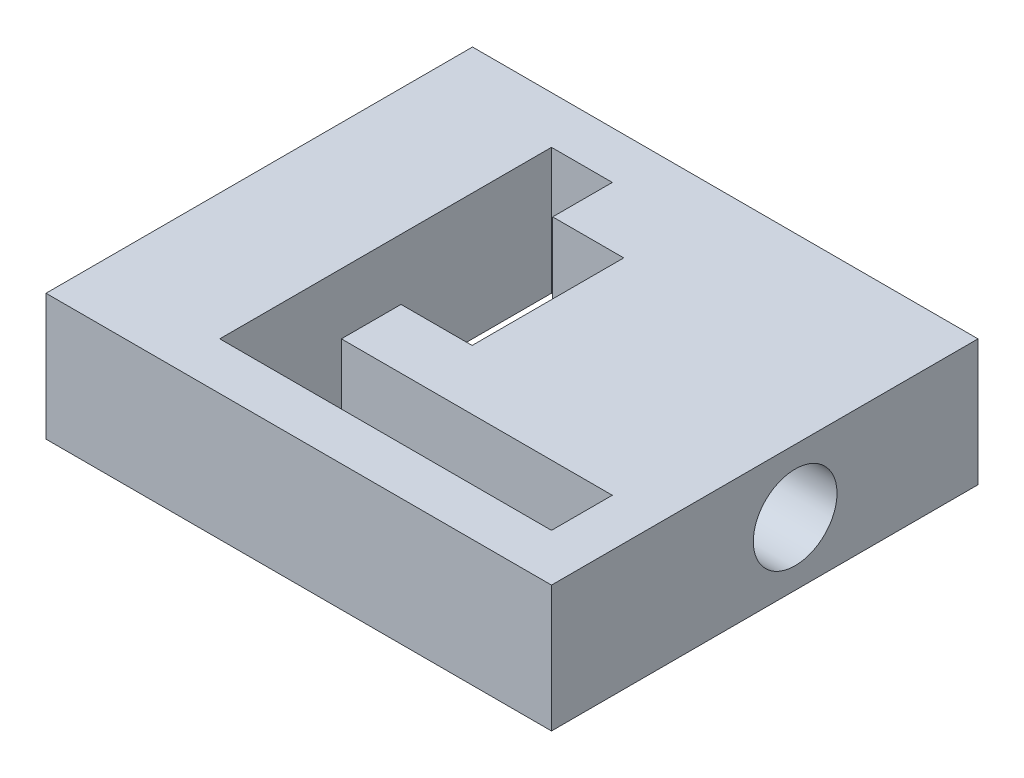
ISO-10303-21;
HEADER;
FILE_DESCRIPTION(('STEP AP214'),'2;1');
FILE_NAME('part.step','',(''),(''),'','','');
FILE_SCHEMA(('AUTOMOTIVE_DESIGN { 1 0 10303 214 1 1 1 1 }'));
ENDSEC;
DATA;
#1=APPLICATION_CONTEXT('core data for automotive mechanical design processes');
#2=APPLICATION_PROTOCOL_DEFINITION('international standard','automotive_design',2000,#1);
#3=PRODUCT_CONTEXT('',#1,'mechanical');
#4=PRODUCT('Part','Part','',(#3));
#5=PRODUCT_RELATED_PRODUCT_CATEGORY('part','',(#4));
#6=PRODUCT_DEFINITION_FORMATION('','',#4);
#7=PRODUCT_DEFINITION_CONTEXT('part definition',#1,'design');
#8=PRODUCT_DEFINITION('design','',#6,#7);
#9=PRODUCT_DEFINITION_SHAPE('','',#8);
#10=(LENGTH_UNIT() NAMED_UNIT(*) SI_UNIT(.MILLI.,.METRE.));
#11=(NAMED_UNIT(*) PLANE_ANGLE_UNIT() SI_UNIT($,.RADIAN.));
#12=(NAMED_UNIT(*) SI_UNIT($,.STERADIAN.) SOLID_ANGLE_UNIT());
#13=UNCERTAINTY_MEASURE_WITH_UNIT(LENGTH_MEASURE(1.E-05),#10,'distance_accuracy_value','');
#14=(GEOMETRIC_REPRESENTATION_CONTEXT(3) GLOBAL_UNCERTAINTY_ASSIGNED_CONTEXT((#13)) GLOBAL_UNIT_ASSIGNED_CONTEXT((#10,
#11,#12)) REPRESENTATION_CONTEXT('',''));
#15=CARTESIAN_POINT('',(0.,0.,0.));
#16=DIRECTION('',(0.,0.,1.));
#17=DIRECTION('',(1.,0.,0.));
#18=AXIS2_PLACEMENT_3D('',#15,#16,#17);
#19=CARTESIAN_POINT('',(6.85,8.,-6.85));
#20=DIRECTION('',(-1.,0.,0.));
#21=DIRECTION('',(0.,0.,1.));
#22=AXIS2_PLACEMENT_3D('',#19,#20,#21);
#23=PLANE('',#22);
#24=DIRECTION('',(0.,1.,0.));
#25=VECTOR('',#24,1.);
#26=CARTESIAN_POINT('',(6.85,0.,-20.225));
#27=LINE('',#26,#25);
#28=CARTESIAN_POINT('',(6.85,0.,-20.225));
#29=VERTEX_POINT('',#28);
#30=CARTESIAN_POINT('',(6.85,8.,-20.225));
#31=VERTEX_POINT('',#30);
#32=EDGE_CURVE('E192',#29,#31,#27,.T.);
#33=ORIENTED_EDGE('',*,*,#32,.T.);
#34=DIRECTION('',(0.,0.,-1.));
#35=VECTOR('',#34,1.);
#36=CARTESIAN_POINT('',(6.85,8.,-6.85));
#37=LINE('',#36,#35);
#38=CARTESIAN_POINT('',(6.85,8.,-24.));
#39=VERTEX_POINT('',#38);
#40=EDGE_CURVE('E212',#31,#39,#37,.T.);
#41=ORIENTED_EDGE('',*,*,#40,.T.);
#42=DIRECTION('',(0.,-1.,0.));
#43=VECTOR('',#42,1.);
#44=CARTESIAN_POINT('',(6.85,8.,-24.));
#45=LINE('',#44,#43);
#46=CARTESIAN_POINT('',(6.85,0.,-24.));
#47=VERTEX_POINT('',#46);
#48=EDGE_CURVE('E215',#39,#47,#45,.T.);
#49=ORIENTED_EDGE('',*,*,#48,.T.);
#50=DIRECTION('',(0.,0.,-1.));
#51=VECTOR('',#50,1.);
#52=CARTESIAN_POINT('',(6.85,0.,-6.85));
#53=LINE('',#52,#51);
#54=EDGE_CURVE('E230',#29,#47,#53,.T.);
#55=ORIENTED_EDGE('',*,*,#54,.F.);
#56=EDGE_LOOP('',(#33,#41,#49,#55));
#57=FACE_BOUND('',#56,.T.);
#58=ADVANCED_FACE('F32',(#57),#23,.T.);
#59=CARTESIAN_POINT('',(0.,8.,0.));
#60=DIRECTION('',(0.,-1.,0.));
#61=DIRECTION('',(0.,0.,-1.));
#62=AXIS2_PLACEMENT_3D('',#59,#60,#61);
#63=PLANE('',#62);
#64=DIRECTION('',(-1.,0.,0.));
#65=VECTOR('',#64,1.);
#66=CARTESIAN_POINT('',(0.,8.,-27.));
#67=LINE('',#66,#65);
#68=CARTESIAN_POINT('',(27.,8.,-27.));
#69=VERTEX_POINT('',#68);
#70=CARTESIAN_POINT('',(-5.,8.,-27.));
#71=VERTEX_POINT('',#70);
#72=EDGE_CURVE('E248',#69,#71,#67,.T.);
#73=ORIENTED_EDGE('',*,*,#72,.T.);
#74=DIRECTION('',(0.,0.,-1.));
#75=VECTOR('',#74,1.);
#76=CARTESIAN_POINT('',(-5.,8.,-27.));
#77=LINE('',#76,#75);
#78=CARTESIAN_POINT('',(-5.,8.,0.));
#79=VERTEX_POINT('',#78);
#80=EDGE_CURVE('E160',#79,#71,#77,.T.);
#81=ORIENTED_EDGE('',*,*,#80,.F.);
#82=DIRECTION('',(1.,0.,0.));
#83=VECTOR('',#82,1.);
#84=CARTESIAN_POINT('',(0.,8.,0.));
#85=LINE('',#84,#83);
#86=CARTESIAN_POINT('',(27.,8.,0.));
#87=VERTEX_POINT('',#86);
#88=EDGE_CURVE('E144',#79,#87,#85,.T.);
#89=ORIENTED_EDGE('',*,*,#88,.T.);
#90=DIRECTION('',(0.,0.,-1.));
#91=VECTOR('',#90,1.);
#92=CARTESIAN_POINT('',(27.,8.,0.));
#93=LINE('',#92,#91);
#94=EDGE_CURVE('E246',#87,#69,#93,.T.);
#95=ORIENTED_EDGE('',*,*,#94,.T.);
#96=EDGE_LOOP('',(#73,#81,#89,#95));
#97=FACE_BOUND('',#96,.T.);
#98=ORIENTED_EDGE('',*,*,#40,.F.);
#99=DIRECTION('',(-1.,0.,0.));
#100=VECTOR('',#99,1.);
#101=CARTESIAN_POINT('',(6.85,8.,-20.225));
#102=LINE('',#101,#100);
#103=CARTESIAN_POINT('',(11.35,8.,-20.225));
#104=VERTEX_POINT('',#103);
#105=EDGE_CURVE('E179',#104,#31,#102,.T.);
#106=ORIENTED_EDGE('',*,*,#105,.F.);
#107=DIRECTION('',(0.,0.,-1.));
#108=VECTOR('',#107,1.);
#109=CARTESIAN_POINT('',(11.35,8.,-20.225));
#110=LINE('',#109,#108);
#111=CARTESIAN_POINT('',(11.35,8.,-10.625));
#112=VERTEX_POINT('',#111);
#113=EDGE_CURVE('E188',#112,#104,#110,.T.);
#114=ORIENTED_EDGE('',*,*,#113,.F.);
#115=DIRECTION('',(1.,0.,0.));
#116=VECTOR('',#115,1.);
#117=CARTESIAN_POINT('',(6.85,8.,-10.625));
#118=LINE('',#117,#116);
#119=CARTESIAN_POINT('',(6.85,8.,-10.625));
#120=VERTEX_POINT('',#119);
#121=EDGE_CURVE('E176',#120,#112,#118,.T.);
#122=ORIENTED_EDGE('',*,*,#121,.F.);
#123=CARTESIAN_POINT('',(6.85,8.,-6.85));
#124=VERTEX_POINT('',#123);
#125=EDGE_CURVE('E213',#124,#120,#37,.T.);
#126=ORIENTED_EDGE('',*,*,#125,.F.);
#127=DIRECTION('',(-1.,0.,0.));
#128=VECTOR('',#127,1.);
#129=CARTESIAN_POINT('',(24.,8.,-6.85));
#130=LINE('',#129,#128);
#131=CARTESIAN_POINT('',(24.,8.,-6.85));
#132=VERTEX_POINT('',#131);
#133=EDGE_CURVE('E210',#132,#124,#130,.T.);
#134=ORIENTED_EDGE('',*,*,#133,.F.);
#135=DIRECTION('',(0.,0.,-1.));
#136=VECTOR('',#135,1.);
#137=CARTESIAN_POINT('',(24.,8.,-3.));
#138=LINE('',#137,#136);
#139=CARTESIAN_POINT('',(24.,8.,-3.));
#140=VERTEX_POINT('',#139);
#141=EDGE_CURVE('E208',#140,#132,#138,.T.);
#142=ORIENTED_EDGE('',*,*,#141,.F.);
#143=DIRECTION('',(1.,0.,0.));
#144=VECTOR('',#143,1.);
#145=CARTESIAN_POINT('',(3.,8.,-3.));
#146=LINE('',#145,#144);
#147=CARTESIAN_POINT('',(3.,8.,-3.));
#148=VERTEX_POINT('',#147);
#149=EDGE_CURVE('E206',#148,#140,#146,.T.);
#150=ORIENTED_EDGE('',*,*,#149,.F.);
#151=DIRECTION('',(0.,0.,1.));
#152=VECTOR('',#151,1.);
#153=CARTESIAN_POINT('',(3.,8.,-24.));
#154=LINE('',#153,#152);
#155=CARTESIAN_POINT('',(3.,8.,-24.));
#156=VERTEX_POINT('',#155);
#157=EDGE_CURVE('E203',#156,#148,#154,.T.);
#158=ORIENTED_EDGE('',*,*,#157,.F.);
#159=DIRECTION('',(-1.,0.,0.));
#160=VECTOR('',#159,1.);
#161=CARTESIAN_POINT('',(6.85,8.,-24.));
#162=LINE('',#161,#160);
#163=EDGE_CURVE('E201',#39,#156,#162,.T.);
#164=ORIENTED_EDGE('',*,*,#163,.F.);
#165=EDGE_LOOP('',(#98,#106,#114,#122,#126,#134,#142,#150,#158,#164));
#166=FACE_BOUND('',#165,.T.);
#167=ADVANCED_FACE('F258',(#97,#166),#63,.F.);
#168=CARTESIAN_POINT('',(0.,0.,0.));
#169=DIRECTION('',(0.,-1.,0.));
#170=DIRECTION('',(0.,0.,-1.));
#171=AXIS2_PLACEMENT_3D('',#168,#169,#170);
#172=PLANE('',#171);
#173=DIRECTION('',(-1.,0.,0.));
#174=VECTOR('',#173,1.);
#175=CARTESIAN_POINT('',(6.85,0.,-20.225));
#176=LINE('',#175,#174);
#177=CARTESIAN_POINT('',(11.35,0.,-20.225));
#178=VERTEX_POINT('',#177);
#179=EDGE_CURVE('E182',#178,#29,#176,.T.);
#180=ORIENTED_EDGE('',*,*,#179,.T.);
#181=ORIENTED_EDGE('',*,*,#54,.T.);
#182=DIRECTION('',(-1.,0.,0.));
#183=VECTOR('',#182,1.);
#184=CARTESIAN_POINT('',(6.85,0.,-24.));
#185=LINE('',#184,#183);
#186=CARTESIAN_POINT('',(3.,0.,-24.));
#187=VERTEX_POINT('',#186);
#188=EDGE_CURVE('E195',#47,#187,#185,.T.);
#189=ORIENTED_EDGE('',*,*,#188,.T.);
#190=DIRECTION('',(0.,0.,1.));
#191=VECTOR('',#190,1.);
#192=CARTESIAN_POINT('',(3.,0.,-24.));
#193=LINE('',#192,#191);
#194=CARTESIAN_POINT('',(3.,0.,-3.));
#195=VERTEX_POINT('',#194);
#196=EDGE_CURVE('E218',#187,#195,#193,.T.);
#197=ORIENTED_EDGE('',*,*,#196,.T.);
#198=DIRECTION('',(1.,0.,0.));
#199=VECTOR('',#198,1.);
#200=CARTESIAN_POINT('',(3.,0.,-3.));
#201=LINE('',#200,#199);
#202=CARTESIAN_POINT('',(24.,0.,-3.));
#203=VERTEX_POINT('',#202);
#204=EDGE_CURVE('E221',#195,#203,#201,.T.);
#205=ORIENTED_EDGE('',*,*,#204,.T.);
#206=DIRECTION('',(0.,0.,-1.));
#207=VECTOR('',#206,1.);
#208=CARTESIAN_POINT('',(24.,0.,-3.));
#209=LINE('',#208,#207);
#210=CARTESIAN_POINT('',(24.,0.,-6.85));
#211=VERTEX_POINT('',#210);
#212=EDGE_CURVE('E224',#203,#211,#209,.T.);
#213=ORIENTED_EDGE('',*,*,#212,.T.);
#214=DIRECTION('',(-1.,0.,0.));
#215=VECTOR('',#214,1.);
#216=CARTESIAN_POINT('',(24.,0.,-6.85));
#217=LINE('',#216,#215);
#218=CARTESIAN_POINT('',(6.85,0.,-6.85));
#219=VERTEX_POINT('',#218);
#220=EDGE_CURVE('E227',#211,#219,#217,.T.);
#221=ORIENTED_EDGE('',*,*,#220,.T.);
#222=CARTESIAN_POINT('',(6.85,0.,-10.625));
#223=VERTEX_POINT('',#222);
#224=EDGE_CURVE('E204',#219,#223,#53,.T.);
#225=ORIENTED_EDGE('',*,*,#224,.T.);
#226=DIRECTION('',(1.,0.,0.));
#227=VECTOR('',#226,1.);
#228=CARTESIAN_POINT('',(6.85,0.,-10.625));
#229=LINE('',#228,#227);
#230=CARTESIAN_POINT('',(11.35,0.,-10.625));
#231=VERTEX_POINT('',#230);
#232=EDGE_CURVE('E47',#223,#231,#229,.T.);
#233=ORIENTED_EDGE('',*,*,#232,.T.);
#234=DIRECTION('',(0.,0.,-1.));
#235=VECTOR('',#234,1.);
#236=CARTESIAN_POINT('',(11.35,0.,-20.225));
#237=LINE('',#236,#235);
#238=EDGE_CURVE('E178',#231,#178,#237,.T.);
#239=ORIENTED_EDGE('',*,*,#238,.T.);
#240=EDGE_LOOP('',(#180,#181,#189,#197,#205,#213,#221,#225,#233,#239));
#241=FACE_BOUND('',#240,.T.);
#242=DIRECTION('',(1.,0.,0.));
#243=VECTOR('',#242,1.);
#244=CARTESIAN_POINT('',(0.,0.,0.));
#245=LINE('',#244,#243);
#246=CARTESIAN_POINT('',(-5.,0.,0.));
#247=VERTEX_POINT('',#246);
#248=CARTESIAN_POINT('',(27.,0.,0.));
#249=VERTEX_POINT('',#248);
#250=EDGE_CURVE('E150',#247,#249,#245,.T.);
#251=ORIENTED_EDGE('',*,*,#250,.F.);
#252=DIRECTION('',(0.,0.,1.));
#253=VECTOR('',#252,1.);
#254=CARTESIAN_POINT('',(-5.,0.,-27.));
#255=LINE('',#254,#253);
#256=CARTESIAN_POINT('',(-5.,0.,-27.));
#257=VERTEX_POINT('',#256);
#258=EDGE_CURVE('E148',#257,#247,#255,.T.);
#259=ORIENTED_EDGE('',*,*,#258,.F.);
#260=DIRECTION('',(-1.,0.,0.));
#261=VECTOR('',#260,1.);
#262=CARTESIAN_POINT('',(0.,0.,-27.));
#263=LINE('',#262,#261);
#264=CARTESIAN_POINT('',(27.,0.,-27.));
#265=VERTEX_POINT('',#264);
#266=EDGE_CURVE('E135',#265,#257,#263,.T.);
#267=ORIENTED_EDGE('',*,*,#266,.F.);
#268=DIRECTION('',(0.,0.,-1.));
#269=VECTOR('',#268,1.);
#270=CARTESIAN_POINT('',(27.,0.,0.));
#271=LINE('',#270,#269);
#272=EDGE_CURVE('E145',#249,#265,#271,.T.);
#273=ORIENTED_EDGE('',*,*,#272,.F.);
#274=EDGE_LOOP('',(#251,#259,#267,#273));
#275=FACE_BOUND('',#274,.T.);
#276=ADVANCED_FACE('F149',(#241,#275),#172,.T.);
#277=CARTESIAN_POINT('',(0.,8.,0.));
#278=DIRECTION('',(0.,0.,-1.));
#279=DIRECTION('',(-1.,0.,0.));
#280=AXIS2_PLACEMENT_3D('',#277,#278,#279);
#281=PLANE('',#280);
#282=ORIENTED_EDGE('',*,*,#250,.T.);
#283=DIRECTION('',(0.,-1.,0.));
#284=VECTOR('',#283,1.);
#285=CARTESIAN_POINT('',(27.,8.,0.));
#286=LINE('',#285,#284);
#287=EDGE_CURVE('E11',#87,#249,#286,.T.);
#288=ORIENTED_EDGE('',*,*,#287,.F.);
#289=ORIENTED_EDGE('',*,*,#88,.F.);
#290=DIRECTION('',(0.,1.,0.));
#291=VECTOR('',#290,1.);
#292=CARTESIAN_POINT('',(-5.,0.,0.));
#293=LINE('',#292,#291);
#294=EDGE_CURVE('E154',#247,#79,#293,.T.);
#295=ORIENTED_EDGE('',*,*,#294,.F.);
#296=EDGE_LOOP('',(#282,#288,#289,#295));
#297=FACE_BOUND('',#296,.T.);
#298=ADVANCED_FACE('F256',(#297),#281,.F.);
#299=CARTESIAN_POINT('',(27.,8.,0.));
#300=DIRECTION('',(-1.,0.,0.));
#301=DIRECTION('',(0.,0.,1.));
#302=AXIS2_PLACEMENT_3D('',#299,#300,#301);
#303=PLANE('',#302);
#304=CARTESIAN_POINT('',(27.,4.,-15.425));
#305=DIRECTION('',(1.,0.,0.));
#306=DIRECTION('',(0.,0.,-1.));
#307=AXIS2_PLACEMENT_3D('',#304,#305,#306);
#308=CIRCLE('',#307,2.65);
#309=CARTESIAN_POINT('',(27.,4.,-18.075));
#310=VERTEX_POINT('',#309);
#311=EDGE_CURVE('E170',#310,#310,#308,.T.);
#312=ORIENTED_EDGE('',*,*,#311,.F.);
#313=EDGE_LOOP('',(#312));
#314=FACE_BOUND('',#313,.T.);
#315=ORIENTED_EDGE('',*,*,#272,.T.);
#316=DIRECTION('',(0.,-1.,0.));
#317=VECTOR('',#316,1.);
#318=CARTESIAN_POINT('',(27.,8.,-27.));
#319=LINE('',#318,#317);
#320=EDGE_CURVE('E40',#69,#265,#319,.T.);
#321=ORIENTED_EDGE('',*,*,#320,.F.);
#322=ORIENTED_EDGE('',*,*,#94,.F.);
#323=ORIENTED_EDGE('',*,*,#287,.T.);
#324=EDGE_LOOP('',(#315,#321,#322,#323));
#325=FACE_BOUND('',#324,.T.);
#326=ADVANCED_FACE('F252',(#314,#325),#303,.F.);
#327=CARTESIAN_POINT('',(0.,8.,-27.));
#328=DIRECTION('',(0.,0.,1.));
#329=DIRECTION('',(1.,0.,0.));
#330=AXIS2_PLACEMENT_3D('',#327,#328,#329);
#331=PLANE('',#330);
#332=ORIENTED_EDGE('',*,*,#266,.T.);
#333=DIRECTION('',(0.,-1.,0.));
#334=VECTOR('',#333,1.);
#335=CARTESIAN_POINT('',(-5.,0.,-27.));
#336=LINE('',#335,#334);
#337=EDGE_CURVE('E140',#71,#257,#336,.T.);
#338=ORIENTED_EDGE('',*,*,#337,.F.);
#339=ORIENTED_EDGE('',*,*,#72,.F.);
#340=ORIENTED_EDGE('',*,*,#320,.T.);
#341=EDGE_LOOP('',(#332,#338,#339,#340));
#342=FACE_BOUND('',#341,.T.);
#343=ADVANCED_FACE('F137',(#342),#331,.F.);
#344=CARTESIAN_POINT('',(6.85,8.,-24.));
#345=DIRECTION('',(0.,0.,1.));
#346=DIRECTION('',(1.,0.,0.));
#347=AXIS2_PLACEMENT_3D('',#344,#345,#346);
#348=PLANE('',#347);
#349=ORIENTED_EDGE('',*,*,#188,.F.);
#350=ORIENTED_EDGE('',*,*,#48,.F.);
#351=ORIENTED_EDGE('',*,*,#163,.T.);
#352=DIRECTION('',(0.,-1.,0.));
#353=VECTOR('',#352,1.);
#354=CARTESIAN_POINT('',(3.,8.,-24.));
#355=LINE('',#354,#353);
#356=EDGE_CURVE('E242',#156,#187,#355,.T.);
#357=ORIENTED_EDGE('',*,*,#356,.T.);
#358=EDGE_LOOP('',(#349,#350,#351,#357));
#359=FACE_BOUND('',#358,.T.);
#360=ADVANCED_FACE('F272',(#359),#348,.T.);
#361=CARTESIAN_POINT('',(3.,8.,-24.));
#362=DIRECTION('',(1.,0.,0.));
#363=DIRECTION('',(0.,0.,-1.));
#364=AXIS2_PLACEMENT_3D('',#361,#362,#363);
#365=PLANE('',#364);
#366=ORIENTED_EDGE('',*,*,#196,.F.);
#367=ORIENTED_EDGE('',*,*,#356,.F.);
#368=ORIENTED_EDGE('',*,*,#157,.T.);
#369=DIRECTION('',(0.,-1.,0.));
#370=VECTOR('',#369,1.);
#371=CARTESIAN_POINT('',(3.,8.,-3.));
#372=LINE('',#371,#370);
#373=EDGE_CURVE('E240',#148,#195,#372,.T.);
#374=ORIENTED_EDGE('',*,*,#373,.T.);
#375=EDGE_LOOP('',(#366,#367,#368,#374));
#376=FACE_BOUND('',#375,.T.);
#377=ADVANCED_FACE('F300',(#376),#365,.T.);
#378=CARTESIAN_POINT('',(3.,8.,-3.));
#379=DIRECTION('',(0.,0.,-1.));
#380=DIRECTION('',(-1.,0.,0.));
#381=AXIS2_PLACEMENT_3D('',#378,#379,#380);
#382=PLANE('',#381);
#383=ORIENTED_EDGE('',*,*,#204,.F.);
#384=ORIENTED_EDGE('',*,*,#373,.F.);
#385=ORIENTED_EDGE('',*,*,#149,.T.);
#386=DIRECTION('',(0.,-1.,0.));
#387=VECTOR('',#386,1.);
#388=CARTESIAN_POINT('',(24.,8.,-3.));
#389=LINE('',#388,#387);
#390=EDGE_CURVE('E238',#140,#203,#389,.T.);
#391=ORIENTED_EDGE('',*,*,#390,.T.);
#392=EDGE_LOOP('',(#383,#384,#385,#391));
#393=FACE_BOUND('',#392,.T.);
#394=ADVANCED_FACE('F297',(#393),#382,.T.);
#395=CARTESIAN_POINT('',(24.,8.,-3.));
#396=DIRECTION('',(-1.,0.,0.));
#397=DIRECTION('',(0.,0.,1.));
#398=AXIS2_PLACEMENT_3D('',#395,#396,#397);
#399=PLANE('',#398);
#400=ORIENTED_EDGE('',*,*,#212,.F.);
#401=ORIENTED_EDGE('',*,*,#390,.F.);
#402=ORIENTED_EDGE('',*,*,#141,.T.);
#403=DIRECTION('',(0.,-1.,0.));
#404=VECTOR('',#403,1.);
#405=CARTESIAN_POINT('',(24.,8.,-6.85));
#406=LINE('',#405,#404);
#407=EDGE_CURVE('E236',#132,#211,#406,.T.);
#408=ORIENTED_EDGE('',*,*,#407,.T.);
#409=EDGE_LOOP('',(#400,#401,#402,#408));
#410=FACE_BOUND('',#409,.T.);
#411=ADVANCED_FACE('F294',(#410),#399,.T.);
#412=CARTESIAN_POINT('',(24.,8.,-6.85));
#413=DIRECTION('',(0.,0.,1.));
#414=DIRECTION('',(1.,0.,0.));
#415=AXIS2_PLACEMENT_3D('',#412,#413,#414);
#416=PLANE('',#415);
#417=ORIENTED_EDGE('',*,*,#220,.F.);
#418=ORIENTED_EDGE('',*,*,#407,.F.);
#419=ORIENTED_EDGE('',*,*,#133,.T.);
#420=DIRECTION('',(0.,-1.,0.));
#421=VECTOR('',#420,1.);
#422=CARTESIAN_POINT('',(6.85,8.,-6.85));
#423=LINE('',#422,#421);
#424=EDGE_CURVE('E55',#124,#219,#423,.T.);
#425=ORIENTED_EDGE('',*,*,#424,.T.);
#426=EDGE_LOOP('',(#417,#418,#419,#425));
#427=FACE_BOUND('',#426,.T.);
#428=ADVANCED_FACE('F289',(#427),#416,.T.);
#429=DIRECTION('',(0.,1.,0.));
#430=VECTOR('',#429,1.);
#431=CARTESIAN_POINT('',(6.85,0.,-10.625));
#432=LINE('',#431,#430);
#433=EDGE_CURVE('E185',#223,#120,#432,.T.);
#434=ORIENTED_EDGE('',*,*,#433,.F.);
#435=ORIENTED_EDGE('',*,*,#224,.F.);
#436=ORIENTED_EDGE('',*,*,#424,.F.);
#437=ORIENTED_EDGE('',*,*,#125,.T.);
#438=EDGE_LOOP('',(#434,#435,#436,#437));
#439=FACE_BOUND('',#438,.T.);
#440=ADVANCED_FACE('F284',(#439),#23,.T.);
#441=CARTESIAN_POINT('',(6.85,0.,-20.225));
#442=DIRECTION('',(0.,0.,-1.));
#443=DIRECTION('',(-1.,0.,0.));
#444=AXIS2_PLACEMENT_3D('',#441,#442,#443);
#445=PLANE('',#444);
#446=ORIENTED_EDGE('',*,*,#105,.T.);
#447=ORIENTED_EDGE('',*,*,#32,.F.);
#448=ORIENTED_EDGE('',*,*,#179,.F.);
#449=DIRECTION('',(0.,1.,0.));
#450=VECTOR('',#449,1.);
#451=CARTESIAN_POINT('',(11.35,0.,-20.225));
#452=LINE('',#451,#450);
#453=EDGE_CURVE('E196',#178,#104,#452,.T.);
#454=ORIENTED_EDGE('',*,*,#453,.T.);
#455=EDGE_LOOP('',(#446,#447,#448,#454));
#456=FACE_BOUND('',#455,.T.);
#457=ADVANCED_FACE('F278',(#456),#445,.F.);
#458=CARTESIAN_POINT('',(11.35,0.,-20.225));
#459=DIRECTION('',(1.,0.,0.));
#460=DIRECTION('',(0.,0.,-1.));
#461=AXIS2_PLACEMENT_3D('',#458,#459,#460);
#462=PLANE('',#461);
#463=CARTESIAN_POINT('',(11.35,4.,-15.425));
#464=DIRECTION('',(1.,0.,0.));
#465=DIRECTION('',(0.,0.,-1.));
#466=AXIS2_PLACEMENT_3D('',#463,#464,#465);
#467=CIRCLE('',#466,2.65);
#468=CARTESIAN_POINT('',(11.35,4.,-18.075));
#469=VERTEX_POINT('',#468);
#470=EDGE_CURVE('E173',#469,#469,#467,.F.);
#471=ORIENTED_EDGE('',*,*,#470,.F.);
#472=EDGE_LOOP('',(#471));
#473=FACE_BOUND('',#472,.T.);
#474=ORIENTED_EDGE('',*,*,#113,.T.);
#475=ORIENTED_EDGE('',*,*,#453,.F.);
#476=ORIENTED_EDGE('',*,*,#238,.F.);
#477=DIRECTION('',(0.,1.,0.));
#478=VECTOR('',#477,1.);
#479=CARTESIAN_POINT('',(11.35,0.,-10.625));
#480=LINE('',#479,#478);
#481=EDGE_CURVE('E198',#231,#112,#480,.T.);
#482=ORIENTED_EDGE('',*,*,#481,.T.);
#483=EDGE_LOOP('',(#474,#475,#476,#482));
#484=FACE_BOUND('',#483,.T.);
#485=ADVANCED_FACE('F280',(#473,#484),#462,.F.);
#486=CARTESIAN_POINT('',(6.85,0.,-10.625));
#487=DIRECTION('',(0.,0.,1.));
#488=DIRECTION('',(1.,0.,0.));
#489=AXIS2_PLACEMENT_3D('',#486,#487,#488);
#490=PLANE('',#489);
#491=ORIENTED_EDGE('',*,*,#121,.T.);
#492=ORIENTED_EDGE('',*,*,#481,.F.);
#493=ORIENTED_EDGE('',*,*,#232,.F.);
#494=ORIENTED_EDGE('',*,*,#433,.T.);
#495=EDGE_LOOP('',(#491,#492,#493,#494));
#496=FACE_BOUND('',#495,.T.);
#497=ADVANCED_FACE('F386',(#496),#490,.F.);
#498=CARTESIAN_POINT('',(3.85466811942258,4.,-15.425));
#499=DIRECTION('',(1.,0.,0.));
#500=DIRECTION('',(0.,0.,-1.));
#501=AXIS2_PLACEMENT_3D('',#498,#499,#500);
#502=CYLINDRICAL_SURFACE('',#501,2.65);
#503=ORIENTED_EDGE('',*,*,#470,.T.);
#504=EDGE_LOOP('',(#503));
#505=FACE_BOUND('',#504,.T.);
#506=ORIENTED_EDGE('',*,*,#311,.T.);
#507=EDGE_LOOP('',(#506));
#508=FACE_BOUND('',#507,.T.);
#509=ADVANCED_FACE('F382',(#505,#508),#502,.F.);
#510=CARTESIAN_POINT('',(-5.,0.,0.));
#511=DIRECTION('',(1.,0.,0.));
#512=DIRECTION('',(0.,0.,-1.));
#513=AXIS2_PLACEMENT_3D('',#510,#511,#512);
#514=PLANE('',#513);
#515=ORIENTED_EDGE('',*,*,#337,.T.);
#516=ORIENTED_EDGE('',*,*,#258,.T.);
#517=ORIENTED_EDGE('',*,*,#294,.T.);
#518=ORIENTED_EDGE('',*,*,#80,.T.);
#519=EDGE_LOOP('',(#515,#516,#517,#518));
#520=FACE_BOUND('',#519,.T.);
#521=CARTESIAN_POINT('',(-5.,5.,-22.78));
#522=DIRECTION('',(-1.,0.,0.));
#523=DIRECTION('',(0.,0.,1.));
#524=AXIS2_PLACEMENT_3D('',#521,#522,#523);
#525=CIRCLE('',#524,1.25);
#526=CARTESIAN_POINT('',(-5.,5.,-21.53));
#527=VERTEX_POINT('',#526);
#528=EDGE_CURVE('E161',#527,#527,#525,.T.);
#529=ORIENTED_EDGE('',*,*,#528,.F.);
#530=EDGE_LOOP('',(#529));
#531=FACE_BOUND('',#530,.T.);
#532=CARTESIAN_POINT('',(-5.,5.,-4.22));
#533=DIRECTION('',(-1.,0.,0.));
#534=DIRECTION('',(0.,0.,1.));
#535=AXIS2_PLACEMENT_3D('',#532,#533,#534);
#536=CIRCLE('',#535,1.25);
#537=CARTESIAN_POINT('',(-5.,5.,-2.97));
#538=VERTEX_POINT('',#537);
#539=EDGE_CURVE('E445',#538,#538,#536,.T.);
#540=ORIENTED_EDGE('',*,*,#539,.F.);
#541=EDGE_LOOP('',(#540));
#542=FACE_BOUND('',#541,.T.);
#543=ADVANCED_FACE('F157',(#520,#531,#542),#514,.F.);
#544=CARTESIAN_POINT('',(-5.,5.,-22.78));
#545=DIRECTION('',(1.,0.,0.));
#546=DIRECTION('',(0.,0.,-1.));
#547=AXIS2_PLACEMENT_3D('',#544,#545,#546);
#548=CYLINDRICAL_SURFACE('',#547,1.25);
#549=ORIENTED_EDGE('',*,*,#528,.T.);
#550=EDGE_LOOP('',(#549));
#551=FACE_BOUND('',#550,.T.);
#552=CARTESIAN_POINT('',(0.,5.,-22.78));
#553=DIRECTION('',(-1.,0.,0.));
#554=DIRECTION('',(0.,0.,1.));
#555=AXIS2_PLACEMENT_3D('',#552,#553,#554);
#556=CIRCLE('',#555,1.25);
#557=CARTESIAN_POINT('',(0.,5.,-21.53));
#558=VERTEX_POINT('',#557);
#559=EDGE_CURVE('E164',#558,#558,#556,.T.);
#560=ORIENTED_EDGE('',*,*,#559,.F.);
#561=EDGE_LOOP('',(#560));
#562=FACE_BOUND('',#561,.T.);
#563=ADVANCED_FACE('F430',(#551,#562),#548,.F.);
#564=CARTESIAN_POINT('',(-5.,5.,-4.22));
#565=DIRECTION('',(1.,0.,0.));
#566=DIRECTION('',(0.,0.,-1.));
#567=AXIS2_PLACEMENT_3D('',#564,#565,#566);
#568=CYLINDRICAL_SURFACE('',#567,1.25);
#569=ORIENTED_EDGE('',*,*,#539,.T.);
#570=EDGE_LOOP('',(#569));
#571=FACE_BOUND('',#570,.T.);
#572=CARTESIAN_POINT('',(0.,5.,-4.22));
#573=DIRECTION('',(-1.,0.,0.));
#574=DIRECTION('',(0.,0.,1.));
#575=AXIS2_PLACEMENT_3D('',#572,#573,#574);
#576=CIRCLE('',#575,1.25);
#577=CARTESIAN_POINT('',(0.,5.,-2.97));
#578=VERTEX_POINT('',#577);
#579=EDGE_CURVE('E448',#578,#578,#576,.T.);
#580=ORIENTED_EDGE('',*,*,#579,.F.);
#581=EDGE_LOOP('',(#580));
#582=FACE_BOUND('',#581,.T.);
#583=ADVANCED_FACE('F433',(#571,#582),#568,.F.);
#584=CARTESIAN_POINT('',(0.,8.,0.));
#585=DIRECTION('',(1.,0.,0.));
#586=DIRECTION('',(0.,0.,-1.));
#587=AXIS2_PLACEMENT_3D('',#584,#585,#586);
#588=PLANE('',#587);
#589=ORIENTED_EDGE('',*,*,#559,.T.);
#590=EDGE_LOOP('',(#589));
#591=FACE_BOUND('',#590,.T.);
#592=ADVANCED_FACE('F34',(#591),#588,.F.);
#593=ORIENTED_EDGE('',*,*,#579,.T.);
#594=EDGE_LOOP('',(#593));
#595=FACE_BOUND('',#594,.T.);
#596=ADVANCED_FACE('F440',(#595),#588,.F.);
#597=CLOSED_SHELL('',(#58,#167,#276,#298,#326,#343,#360,#377,#394,#411,#428,#440,#457,#485,#497,
#509,#543,#563,#583,#592,#596));
#598=MANIFOLD_SOLID_BREP('B2',#597);
#599=ADVANCED_BREP_SHAPE_REPRESENTATION('',(#18,#598),#14);
#600=SHAPE_DEFINITION_REPRESENTATION(#9,#599);
ENDSEC;
END-ISO-10303-21;
